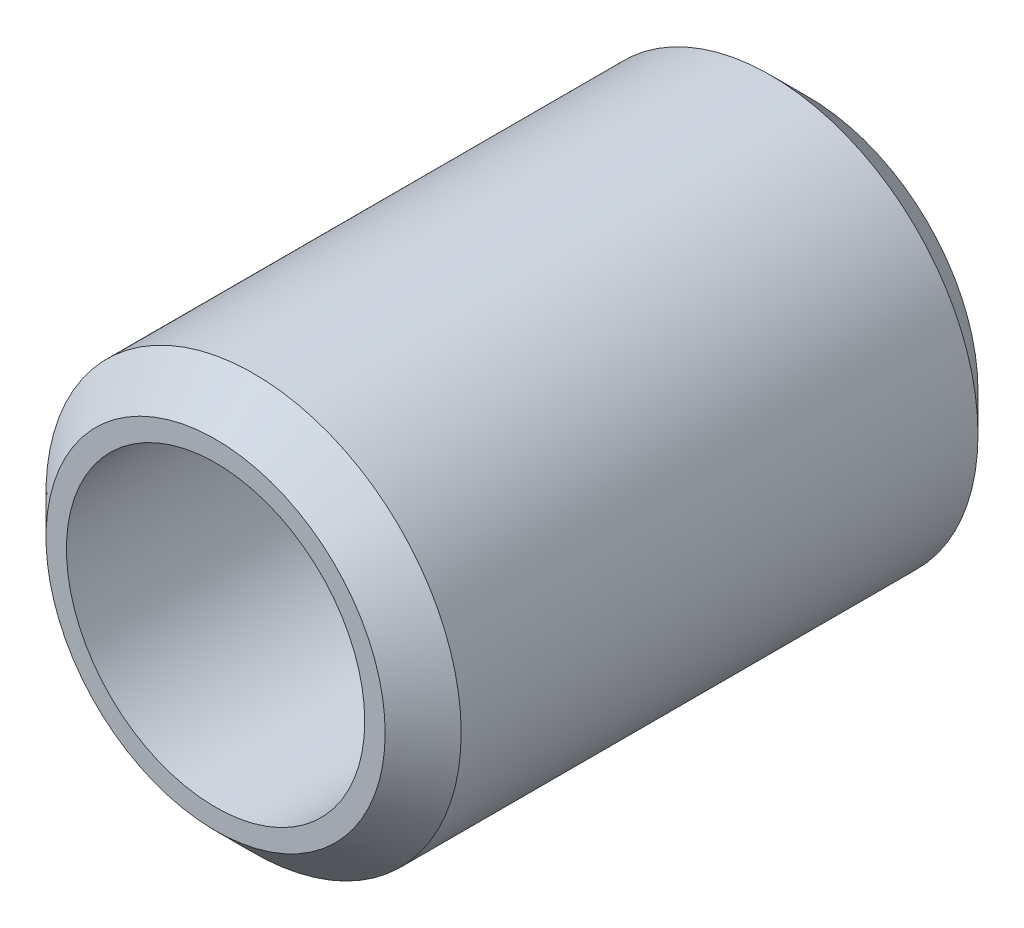
ISO-10303-21;
HEADER;
FILE_DESCRIPTION(('STEP AP214'),'2;1');
FILE_NAME('part.step','',(''),(''),'','','');
FILE_SCHEMA(('AUTOMOTIVE_DESIGN { 1 0 10303 214 1 1 1 1 }'));
ENDSEC;
DATA;
#1=APPLICATION_CONTEXT('core data for automotive mechanical design processes');
#2=APPLICATION_PROTOCOL_DEFINITION('international standard','automotive_design',2000,#1);
#3=PRODUCT_CONTEXT('',#1,'mechanical');
#4=PRODUCT('Part','Part','',(#3));
#5=PRODUCT_RELATED_PRODUCT_CATEGORY('part','',(#4));
#6=PRODUCT_DEFINITION_FORMATION('','',#4);
#7=PRODUCT_DEFINITION_CONTEXT('part definition',#1,'design');
#8=PRODUCT_DEFINITION('design','',#6,#7);
#9=PRODUCT_DEFINITION_SHAPE('','',#8);
#10=(LENGTH_UNIT() NAMED_UNIT(*) SI_UNIT(.MILLI.,.METRE.));
#11=(NAMED_UNIT(*) PLANE_ANGLE_UNIT() SI_UNIT($,.RADIAN.));
#12=(NAMED_UNIT(*) SI_UNIT($,.STERADIAN.) SOLID_ANGLE_UNIT());
#13=UNCERTAINTY_MEASURE_WITH_UNIT(LENGTH_MEASURE(1.E-05),#10,'distance_accuracy_value','');
#14=(GEOMETRIC_REPRESENTATION_CONTEXT(3) GLOBAL_UNCERTAINTY_ASSIGNED_CONTEXT((#13)) GLOBAL_UNIT_ASSIGNED_CONTEXT((#10,
#11,#12)) REPRESENTATION_CONTEXT('',''));
#15=CARTESIAN_POINT('',(0.,0.,0.));
#16=DIRECTION('',(0.,0.,1.));
#17=DIRECTION('',(1.,0.,0.));
#18=AXIS2_PLACEMENT_3D('',#15,#16,#17);
#19=CARTESIAN_POINT('',(0.,0.,3.4544));
#20=DIRECTION('',(0.,0.,-1.));
#21=DIRECTION('',(-1.,0.,0.));
#22=AXIS2_PLACEMENT_3D('',#19,#20,#21);
#23=CONICAL_SURFACE('',#22,2.77495,0.785398163397448);
#24=CARTESIAN_POINT('',(0.,0.,3.9624));
#25=DIRECTION('',(0.,0.,1.));
#26=DIRECTION('',(1.,0.,0.));
#27=AXIS2_PLACEMENT_3D('',#24,#25,#26);
#28=CIRCLE('',#27,2.26695);
#29=CARTESIAN_POINT('',(2.26695,0.,3.9624));
#30=VERTEX_POINT('',#29);
#31=EDGE_CURVE('E54',#30,#30,#28,.T.);
#32=ORIENTED_EDGE('',*,*,#31,.F.);
#33=EDGE_LOOP('',(#32));
#34=FACE_BOUND('',#33,.T.);
#35=CARTESIAN_POINT('',(0.,0.,3.4544));
#36=DIRECTION('',(0.,0.,1.));
#37=DIRECTION('',(1.,0.,0.));
#38=AXIS2_PLACEMENT_3D('',#35,#36,#37);
#39=CIRCLE('',#38,2.77495);
#40=CARTESIAN_POINT('',(2.77495,0.,3.4544));
#41=VERTEX_POINT('',#40);
#42=EDGE_CURVE('E10',#41,#41,#39,.T.);
#43=ORIENTED_EDGE('',*,*,#42,.T.);
#44=EDGE_LOOP('',(#43));
#45=FACE_BOUND('',#44,.T.);
#46=ADVANCED_FACE('F32',(#34,#45),#23,.T.);
#47=CARTESIAN_POINT('',(0.,0.,-3.9624));
#48=DIRECTION('',(0.,0.,1.));
#49=DIRECTION('',(1.,0.,0.));
#50=AXIS2_PLACEMENT_3D('',#47,#48,#49);
#51=CYLINDRICAL_SURFACE('',#50,2.77495);
#52=ORIENTED_EDGE('',*,*,#42,.F.);
#53=EDGE_LOOP('',(#52));
#54=FACE_BOUND('',#53,.T.);
#55=CARTESIAN_POINT('',(0.,0.,-3.4544));
#56=DIRECTION('',(0.,0.,1.));
#57=DIRECTION('',(1.,0.,0.));
#58=AXIS2_PLACEMENT_3D('',#55,#56,#57);
#59=CIRCLE('',#58,2.77495);
#60=CARTESIAN_POINT('',(2.77495,0.,-3.4544));
#61=VERTEX_POINT('',#60);
#62=EDGE_CURVE('E38',#61,#61,#59,.T.);
#63=ORIENTED_EDGE('',*,*,#62,.T.);
#64=EDGE_LOOP('',(#63));
#65=FACE_BOUND('',#64,.T.);
#66=ADVANCED_FACE('F61',(#54,#65),#51,.T.);
#67=CARTESIAN_POINT('',(0.,0.,-3.9624));
#68=DIRECTION('',(0.,0.,1.));
#69=DIRECTION('',(1.,0.,0.));
#70=AXIS2_PLACEMENT_3D('',#67,#68,#69);
#71=CONICAL_SURFACE('',#70,2.26695,0.785398163397448);
#72=ORIENTED_EDGE('',*,*,#62,.F.);
#73=EDGE_LOOP('',(#72));
#74=FACE_BOUND('',#73,.T.);
#75=CARTESIAN_POINT('',(0.,0.,-3.9624));
#76=DIRECTION('',(0.,0.,1.));
#77=DIRECTION('',(1.,0.,0.));
#78=AXIS2_PLACEMENT_3D('',#75,#76,#77);
#79=CIRCLE('',#78,2.26695);
#80=CARTESIAN_POINT('',(2.26695,0.,-3.9624));
#81=VERTEX_POINT('',#80);
#82=EDGE_CURVE('E42',#81,#81,#79,.T.);
#83=ORIENTED_EDGE('',*,*,#82,.T.);
#84=EDGE_LOOP('',(#83));
#85=FACE_BOUND('',#84,.T.);
#86=ADVANCED_FACE('F65',(#74,#85),#71,.T.);
#87=CARTESIAN_POINT('',(0.,1.9939,-3.9624));
#88=DIRECTION('',(0.,0.,1.));
#89=DIRECTION('',(1.,0.,0.));
#90=AXIS2_PLACEMENT_3D('',#87,#88,#89);
#91=PLANE('',#90);
#92=ORIENTED_EDGE('',*,*,#82,.F.);
#93=EDGE_LOOP('',(#92));
#94=FACE_BOUND('',#93,.T.);
#95=CARTESIAN_POINT('',(0.,0.,-3.9624));
#96=DIRECTION('',(0.,0.,1.));
#97=DIRECTION('',(1.,0.,0.));
#98=AXIS2_PLACEMENT_3D('',#95,#96,#97);
#99=CIRCLE('',#98,1.9939);
#100=CARTESIAN_POINT('',(1.9939,0.,-3.9624));
#101=VERTEX_POINT('',#100);
#102=EDGE_CURVE('E46',#101,#101,#99,.T.);
#103=ORIENTED_EDGE('',*,*,#102,.T.);
#104=EDGE_LOOP('',(#103));
#105=FACE_BOUND('',#104,.T.);
#106=ADVANCED_FACE('F70',(#94,#105),#91,.F.);
#107=CARTESIAN_POINT('',(0.,0.,-3.9624));
#108=DIRECTION('',(0.,0.,1.));
#109=DIRECTION('',(1.,0.,0.));
#110=AXIS2_PLACEMENT_3D('',#107,#108,#109);
#111=CYLINDRICAL_SURFACE('',#110,1.9939);
#112=ORIENTED_EDGE('',*,*,#102,.F.);
#113=EDGE_LOOP('',(#112));
#114=FACE_BOUND('',#113,.T.);
#115=CARTESIAN_POINT('',(0.,0.,3.9624));
#116=DIRECTION('',(0.,0.,1.));
#117=DIRECTION('',(1.,0.,0.));
#118=AXIS2_PLACEMENT_3D('',#115,#116,#117);
#119=CIRCLE('',#118,1.9939);
#120=CARTESIAN_POINT('',(1.9939,0.,3.9624));
#121=VERTEX_POINT('',#120);
#122=EDGE_CURVE('E51',#121,#121,#119,.T.);
#123=ORIENTED_EDGE('',*,*,#122,.T.);
#124=EDGE_LOOP('',(#123));
#125=FACE_BOUND('',#124,.T.);
#126=ADVANCED_FACE('F76',(#114,#125),#111,.F.);
#127=CARTESIAN_POINT('',(0.,2.26695,3.9624));
#128=DIRECTION('',(0.,0.,-1.));
#129=DIRECTION('',(-1.,0.,0.));
#130=AXIS2_PLACEMENT_3D('',#127,#128,#129);
#131=PLANE('',#130);
#132=ORIENTED_EDGE('',*,*,#122,.F.);
#133=EDGE_LOOP('',(#132));
#134=FACE_BOUND('',#133,.T.);
#135=ORIENTED_EDGE('',*,*,#31,.T.);
#136=EDGE_LOOP('',(#135));
#137=FACE_BOUND('',#136,.T.);
#138=ADVANCED_FACE('F58',(#134,#137),#131,.F.);
#139=CLOSED_SHELL('',(#46,#66,#86,#106,#126,#138));
#140=MANIFOLD_SOLID_BREP('B2',#139);
#141=ADVANCED_BREP_SHAPE_REPRESENTATION('',(#18,#140),#14);
#142=SHAPE_DEFINITION_REPRESENTATION(#9,#141);
ENDSEC;
END-ISO-10303-21;
